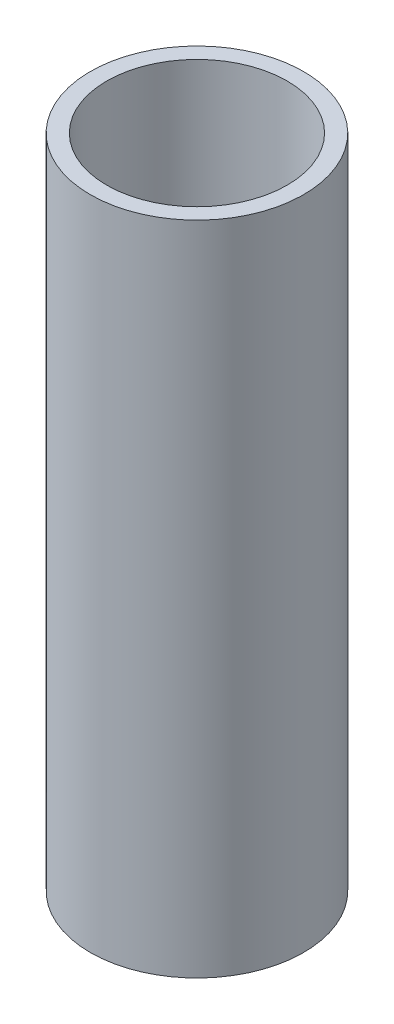
ISO-10303-21;
HEADER;
FILE_DESCRIPTION(('STEP AP214'),'2;1');
FILE_NAME('part.step','',(''),(''),'','','');
FILE_SCHEMA(('AUTOMOTIVE_DESIGN { 1 0 10303 214 1 1 1 1 }'));
ENDSEC;
DATA;
#1=APPLICATION_CONTEXT('core data for automotive mechanical design processes');
#2=APPLICATION_PROTOCOL_DEFINITION('international standard','automotive_design',2000,#1);
#3=PRODUCT_CONTEXT('',#1,'mechanical');
#4=PRODUCT('Part','Part','',(#3));
#5=PRODUCT_RELATED_PRODUCT_CATEGORY('part','',(#4));
#6=PRODUCT_DEFINITION_FORMATION('','',#4);
#7=PRODUCT_DEFINITION_CONTEXT('part definition',#1,'design');
#8=PRODUCT_DEFINITION('design','',#6,#7);
#9=PRODUCT_DEFINITION_SHAPE('','',#8);
#10=(LENGTH_UNIT() NAMED_UNIT(*) SI_UNIT(.MILLI.,.METRE.));
#11=(NAMED_UNIT(*) PLANE_ANGLE_UNIT() SI_UNIT($,.RADIAN.));
#12=(NAMED_UNIT(*) SI_UNIT($,.STERADIAN.) SOLID_ANGLE_UNIT());
#13=UNCERTAINTY_MEASURE_WITH_UNIT(LENGTH_MEASURE(1.E-05),#10,'distance_accuracy_value','');
#14=(GEOMETRIC_REPRESENTATION_CONTEXT(3) GLOBAL_UNCERTAINTY_ASSIGNED_CONTEXT((#13)) GLOBAL_UNIT_ASSIGNED_CONTEXT((#10,
#11,#12)) REPRESENTATION_CONTEXT('',''));
#15=CARTESIAN_POINT('',(0.,0.,0.));
#16=DIRECTION('',(0.,0.,1.));
#17=DIRECTION('',(1.,0.,0.));
#18=AXIS2_PLACEMENT_3D('',#15,#16,#17);
#19=CARTESIAN_POINT('',(0.,80.,0.));
#20=DIRECTION('',(0.,1.,0.));
#21=DIRECTION('',(0.,0.,1.));
#22=AXIS2_PLACEMENT_3D('',#19,#20,#21);
#23=PLANE('',#22);
#24=CARTESIAN_POINT('',(0.,80.,0.));
#25=DIRECTION('',(0.,1.,0.));
#26=DIRECTION('',(0.,0.,1.));
#27=AXIS2_PLACEMENT_3D('',#24,#25,#26);
#28=CIRCLE('',#27,13.);
#29=CARTESIAN_POINT('',(0.,80.,13.));
#30=VERTEX_POINT('',#29);
#31=EDGE_CURVE('E10',#30,#30,#28,.T.);
#32=ORIENTED_EDGE('',*,*,#31,.T.);
#33=EDGE_LOOP('',(#32));
#34=FACE_BOUND('',#33,.T.);
#35=CARTESIAN_POINT('',(0.,80.,0.));
#36=DIRECTION('',(0.,1.,0.));
#37=DIRECTION('',(0.,0.,1.));
#38=AXIS2_PLACEMENT_3D('',#35,#36,#37);
#39=CIRCLE('',#38,11.);
#40=CARTESIAN_POINT('',(0.,80.,11.));
#41=VERTEX_POINT('',#40);
#42=EDGE_CURVE('E42',#41,#41,#39,.T.);
#43=ORIENTED_EDGE('',*,*,#42,.F.);
#44=EDGE_LOOP('',(#43));
#45=FACE_BOUND('',#44,.T.);
#46=ADVANCED_FACE('F31',(#34,#45),#23,.T.);
#47=CARTESIAN_POINT('',(0.,0.,0.));
#48=DIRECTION('',(0.,1.,0.));
#49=DIRECTION('',(0.,0.,1.));
#50=AXIS2_PLACEMENT_3D('',#47,#48,#49);
#51=PLANE('',#50);
#52=CARTESIAN_POINT('',(0.,0.,0.));
#53=DIRECTION('',(0.,1.,0.));
#54=DIRECTION('',(0.,0.,1.));
#55=AXIS2_PLACEMENT_3D('',#52,#53,#54);
#56=CIRCLE('',#55,13.);
#57=CARTESIAN_POINT('',(0.,0.,13.));
#58=VERTEX_POINT('',#57);
#59=EDGE_CURVE('E35',#58,#58,#56,.T.);
#60=ORIENTED_EDGE('',*,*,#59,.F.);
#61=EDGE_LOOP('',(#60));
#62=FACE_BOUND('',#61,.T.);
#63=CARTESIAN_POINT('',(0.,0.,0.));
#64=DIRECTION('',(0.,1.,0.));
#65=DIRECTION('',(0.,0.,1.));
#66=AXIS2_PLACEMENT_3D('',#63,#64,#65);
#67=CIRCLE('',#66,11.);
#68=CARTESIAN_POINT('',(0.,0.,11.));
#69=VERTEX_POINT('',#68);
#70=EDGE_CURVE('E44',#69,#69,#67,.T.);
#71=ORIENTED_EDGE('',*,*,#70,.T.);
#72=EDGE_LOOP('',(#71));
#73=FACE_BOUND('',#72,.T.);
#74=ADVANCED_FACE('F54',(#62,#73),#51,.F.);
#75=CARTESIAN_POINT('',(0.,80.,0.));
#76=DIRECTION('',(0.,-1.,0.));
#77=DIRECTION('',(0.,0.,-1.));
#78=AXIS2_PLACEMENT_3D('',#75,#76,#77);
#79=CYLINDRICAL_SURFACE('',#78,13.);
#80=ORIENTED_EDGE('',*,*,#31,.F.);
#81=EDGE_LOOP('',(#80));
#82=FACE_BOUND('',#81,.T.);
#83=ORIENTED_EDGE('',*,*,#59,.T.);
#84=EDGE_LOOP('',(#83));
#85=FACE_BOUND('',#84,.T.);
#86=ADVANCED_FACE('F33',(#82,#85),#79,.T.);
#87=CARTESIAN_POINT('',(0.,80.,0.));
#88=DIRECTION('',(0.,-1.,0.));
#89=DIRECTION('',(0.,0.,-1.));
#90=AXIS2_PLACEMENT_3D('',#87,#88,#89);
#91=CYLINDRICAL_SURFACE('',#90,11.);
#92=ORIENTED_EDGE('',*,*,#42,.T.);
#93=EDGE_LOOP('',(#92));
#94=FACE_BOUND('',#93,.T.);
#95=ORIENTED_EDGE('',*,*,#70,.F.);
#96=EDGE_LOOP('',(#95));
#97=FACE_BOUND('',#96,.T.);
#98=ADVANCED_FACE('F50',(#94,#97),#91,.F.);
#99=CLOSED_SHELL('',(#46,#74,#86,#98));
#100=MANIFOLD_SOLID_BREP('B2',#99);
#101=ADVANCED_BREP_SHAPE_REPRESENTATION('',(#18,#100),#14);
#102=SHAPE_DEFINITION_REPRESENTATION(#9,#101);
ENDSEC;
END-ISO-10303-21;
